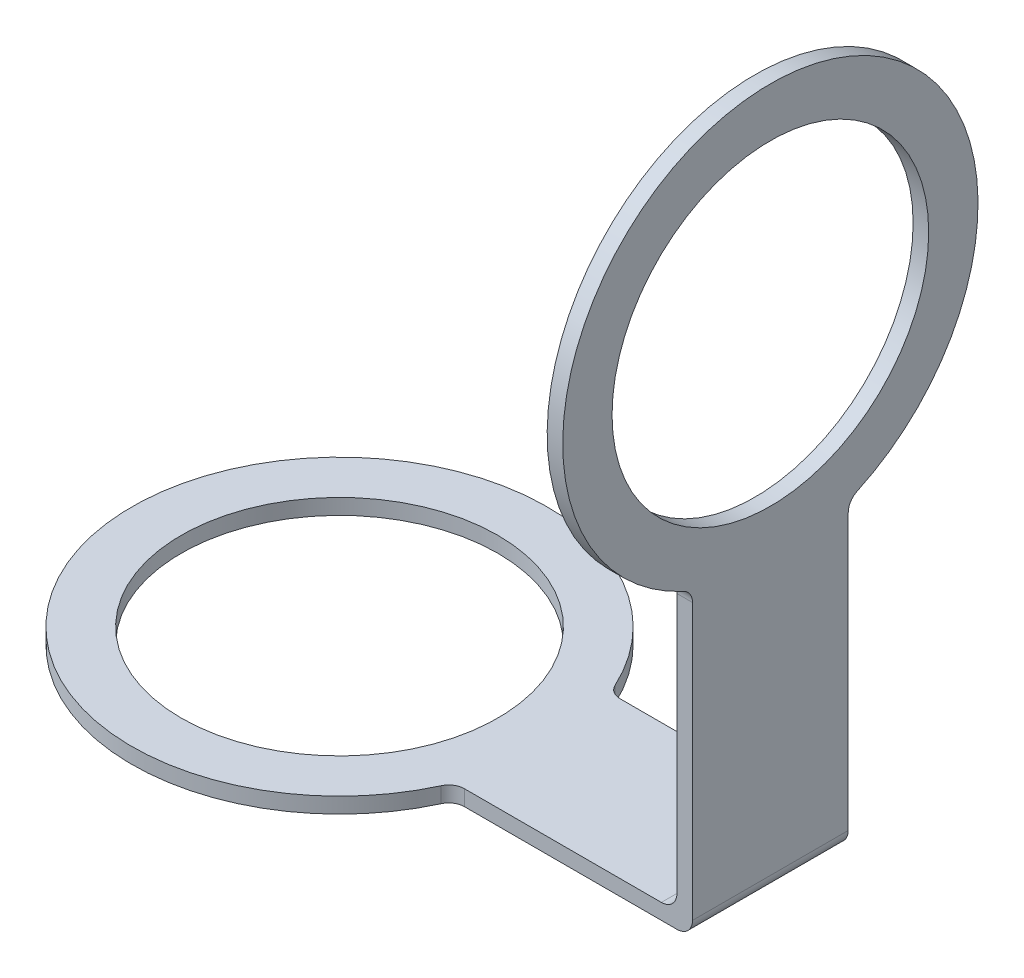
ISO-10303-21;
HEADER;
FILE_DESCRIPTION(('STEP AP214'),'2;1');
FILE_NAME('part.step','',(''),(''),'','','');
FILE_SCHEMA(('AUTOMOTIVE_DESIGN { 1 0 10303 214 1 1 1 1 }'));
ENDSEC;
DATA;
#1=APPLICATION_CONTEXT('core data for automotive mechanical design processes');
#2=APPLICATION_PROTOCOL_DEFINITION('international standard','automotive_design',2000,#1);
#3=PRODUCT_CONTEXT('',#1,'mechanical');
#4=PRODUCT('Part','Part','',(#3));
#5=PRODUCT_RELATED_PRODUCT_CATEGORY('part','',(#4));
#6=PRODUCT_DEFINITION_FORMATION('','',#4);
#7=PRODUCT_DEFINITION_CONTEXT('part definition',#1,'design');
#8=PRODUCT_DEFINITION('design','',#6,#7);
#9=PRODUCT_DEFINITION_SHAPE('','',#8);
#10=(LENGTH_UNIT() NAMED_UNIT(*) SI_UNIT(.MILLI.,.METRE.));
#11=(NAMED_UNIT(*) PLANE_ANGLE_UNIT() SI_UNIT($,.RADIAN.));
#12=(NAMED_UNIT(*) SI_UNIT($,.STERADIAN.) SOLID_ANGLE_UNIT());
#13=UNCERTAINTY_MEASURE_WITH_UNIT(LENGTH_MEASURE(1.E-05),#10,'distance_accuracy_value','');
#14=(GEOMETRIC_REPRESENTATION_CONTEXT(3) GLOBAL_UNCERTAINTY_ASSIGNED_CONTEXT((#13)) GLOBAL_UNIT_ASSIGNED_CONTEXT((#10,
#11,#12)) REPRESENTATION_CONTEXT('',''));
#15=CARTESIAN_POINT('',(0.,0.,0.));
#16=DIRECTION('',(0.,0.,1.));
#17=DIRECTION('',(1.,0.,0.));
#18=AXIS2_PLACEMENT_3D('',#15,#16,#17);
#19=CARTESIAN_POINT('',(0.,3.,0.));
#20=DIRECTION('',(0.,1.,0.));
#21=DIRECTION('',(0.,0.,1.));
#22=AXIS2_PLACEMENT_3D('',#19,#20,#21);
#23=PLANE('',#22);
#24=CARTESIAN_POINT('',(0.,3.,0.));
#25=DIRECTION('',(0.,1.,0.));
#26=DIRECTION('',(0.,0.,1.));
#27=AXIS2_PLACEMENT_3D('',#24,#25,#26);
#28=CIRCLE('',#27,30.5);
#29=CARTESIAN_POINT('',(0.,3.,30.5));
#30=VERTEX_POINT('',#29);
#31=EDGE_CURVE('E230',#30,#30,#28,.T.);
#32=ORIENTED_EDGE('',*,*,#31,.F.);
#33=EDGE_LOOP('',(#32));
#34=FACE_BOUND('',#33,.T.);
#35=DIRECTION('',(1.,0.,0.));
#36=VECTOR('',#35,1.);
#37=CARTESIAN_POINT('',(35.,3.,15.));
#38=LINE('',#37,#36);
#39=CARTESIAN_POINT('',(39.0512483795333,3.,15.));
#40=VERTEX_POINT('',#39);
#41=CARTESIAN_POINT('',(77.,3.,15.));
#42=VERTEX_POINT('',#41);
#43=EDGE_CURVE('E215',#40,#42,#38,.T.);
#44=ORIENTED_EDGE('',*,*,#43,.T.);
#45=DIRECTION('',(0.,0.,-1.));
#46=VECTOR('',#45,1.);
#47=CARTESIAN_POINT('',(77.,3.,0.));
#48=LINE('',#47,#46);
#49=CARTESIAN_POINT('',(77.,3.,-15.));
#50=VERTEX_POINT('',#49);
#51=EDGE_CURVE('E183',#42,#50,#48,.T.);
#52=ORIENTED_EDGE('',*,*,#51,.T.);
#53=DIRECTION('',(-1.,0.,0.));
#54=VECTOR('',#53,1.);
#55=CARTESIAN_POINT('',(35.,3.,-15.));
#56=LINE('',#55,#54);
#57=CARTESIAN_POINT('',(39.0512483795333,3.,-15.));
#58=VERTEX_POINT('',#57);
#59=EDGE_CURVE('E199',#50,#58,#56,.T.);
#60=ORIENTED_EDGE('',*,*,#59,.T.);
#61=CARTESIAN_POINT('',(39.0512483795333,3.,-18.));
#62=DIRECTION('',(0.,1.,0.));
#63=DIRECTION('',(0.,0.,1.));
#64=AXIS2_PLACEMENT_3D('',#61,#62,#63);
#65=CIRCLE('',#64,3.);
#66=CARTESIAN_POINT('',(36.3267426786356,3.,-16.7441860465116));
#67=VERTEX_POINT('',#66);
#68=EDGE_CURVE('E181',#58,#67,#65,.F.);
#69=ORIENTED_EDGE('',*,*,#68,.T.);
#70=CARTESIAN_POINT('',(0.,3.,0.));
#71=DIRECTION('',(0.,1.,0.));
#72=DIRECTION('',(0.,0.,1.));
#73=AXIS2_PLACEMENT_3D('',#70,#71,#72);
#74=CIRCLE('',#73,40.);
#75=CARTESIAN_POINT('',(36.3267426786356,3.,16.7441860465116));
#76=VERTEX_POINT('',#75);
#77=EDGE_CURVE('E147',#67,#76,#74,.T.);
#78=ORIENTED_EDGE('',*,*,#77,.T.);
#79=CARTESIAN_POINT('',(39.0512483795333,3.,18.));
#80=DIRECTION('',(0.,1.,0.));
#81=DIRECTION('',(0.,0.,1.));
#82=AXIS2_PLACEMENT_3D('',#79,#80,#81);
#83=CIRCLE('',#82,3.);
#84=EDGE_CURVE('E175',#76,#40,#83,.F.);
#85=ORIENTED_EDGE('',*,*,#84,.T.);
#86=EDGE_LOOP('',(#44,#52,#60,#69,#78,#85));
#87=FACE_BOUND('',#86,.T.);
#88=ADVANCED_FACE('F32',(#34,#87),#23,.T.);
#89=CARTESIAN_POINT('',(0.,0.,0.));
#90=DIRECTION('',(0.,1.,0.));
#91=DIRECTION('',(0.,0.,1.));
#92=AXIS2_PLACEMENT_3D('',#89,#90,#91);
#93=PLANE('',#92);
#94=DIRECTION('',(1.,0.,0.));
#95=VECTOR('',#94,1.);
#96=CARTESIAN_POINT('',(35.,0.,-15.));
#97=LINE('',#96,#95);
#98=CARTESIAN_POINT('',(39.0512483795333,0.,-15.));
#99=VERTEX_POINT('',#98);
#100=CARTESIAN_POINT('',(80.,0.,-15.));
#101=VERTEX_POINT('',#100);
#102=EDGE_CURVE('E223',#99,#101,#97,.T.);
#103=ORIENTED_EDGE('',*,*,#102,.T.);
#104=DIRECTION('',(0.,0.,1.));
#105=VECTOR('',#104,1.);
#106=CARTESIAN_POINT('',(80.,0.,15.));
#107=LINE('',#106,#105);
#108=CARTESIAN_POINT('',(80.,0.,15.));
#109=VERTEX_POINT('',#108);
#110=EDGE_CURVE('E188',#101,#109,#107,.T.);
#111=ORIENTED_EDGE('',*,*,#110,.T.);
#112=DIRECTION('',(-1.,0.,0.));
#113=VECTOR('',#112,1.);
#114=CARTESIAN_POINT('',(35.,0.,15.));
#115=LINE('',#114,#113);
#116=CARTESIAN_POINT('',(39.0512483795333,0.,15.));
#117=VERTEX_POINT('',#116);
#118=EDGE_CURVE('E227',#109,#117,#115,.T.);
#119=ORIENTED_EDGE('',*,*,#118,.T.);
#120=CARTESIAN_POINT('',(39.0512483795333,0.,18.));
#121=DIRECTION('',(0.,1.,0.));
#122=DIRECTION('',(0.,0.,1.));
#123=AXIS2_PLACEMENT_3D('',#120,#121,#122);
#124=CIRCLE('',#123,3.);
#125=CARTESIAN_POINT('',(36.3267426786356,0.,16.7441860465116));
#126=VERTEX_POINT('',#125);
#127=EDGE_CURVE('E177',#117,#126,#124,.T.);
#128=ORIENTED_EDGE('',*,*,#127,.T.);
#129=CARTESIAN_POINT('',(0.,0.,0.));
#130=DIRECTION('',(0.,1.,0.));
#131=DIRECTION('',(0.,0.,1.));
#132=AXIS2_PLACEMENT_3D('',#129,#130,#131);
#133=CIRCLE('',#132,40.);
#134=CARTESIAN_POINT('',(36.3267426786356,0.,-16.7441860465116));
#135=VERTEX_POINT('',#134);
#136=EDGE_CURVE('E152',#135,#126,#133,.T.);
#137=ORIENTED_EDGE('',*,*,#136,.F.);
#138=CARTESIAN_POINT('',(39.0512483795333,0.,-18.));
#139=DIRECTION('',(0.,1.,0.));
#140=DIRECTION('',(0.,0.,1.));
#141=AXIS2_PLACEMENT_3D('',#138,#139,#140);
#142=CIRCLE('',#141,3.);
#143=EDGE_CURVE('E179',#135,#99,#142,.T.);
#144=ORIENTED_EDGE('',*,*,#143,.T.);
#145=EDGE_LOOP('',(#103,#111,#119,#128,#137,#144));
#146=FACE_BOUND('',#145,.T.);
#147=CARTESIAN_POINT('',(0.,0.,0.));
#148=DIRECTION('',(0.,1.,0.));
#149=DIRECTION('',(0.,0.,1.));
#150=AXIS2_PLACEMENT_3D('',#147,#148,#149);
#151=CIRCLE('',#150,30.5);
#152=CARTESIAN_POINT('',(0.,0.,30.5));
#153=VERTEX_POINT('',#152);
#154=EDGE_CURVE('E229',#153,#153,#151,.T.);
#155=ORIENTED_EDGE('',*,*,#154,.T.);
#156=EDGE_LOOP('',(#155));
#157=FACE_BOUND('',#156,.T.);
#158=ADVANCED_FACE('F236',(#146,#157),#93,.F.);
#159=CARTESIAN_POINT('',(0.,3.,0.));
#160=DIRECTION('',(0.,-1.,0.));
#161=DIRECTION('',(0.,0.,-1.));
#162=AXIS2_PLACEMENT_3D('',#159,#160,#161);
#163=CYLINDRICAL_SURFACE('',#162,40.);
#164=ORIENTED_EDGE('',*,*,#136,.T.);
#165=DIRECTION('',(0.,-1.,0.));
#166=VECTOR('',#165,1.);
#167=CARTESIAN_POINT('',(36.3267426786356,3.,16.7441860465116));
#168=LINE('',#167,#166);
#169=EDGE_CURVE('E168',#126,#76,#168,.F.);
#170=ORIENTED_EDGE('',*,*,#169,.T.);
#171=ORIENTED_EDGE('',*,*,#77,.F.);
#172=DIRECTION('',(0.,-1.,0.));
#173=VECTOR('',#172,1.);
#174=CARTESIAN_POINT('',(36.3267426786356,3.,-16.7441860465116));
#175=LINE('',#174,#173);
#176=EDGE_CURVE('E165',#67,#135,#175,.T.);
#177=ORIENTED_EDGE('',*,*,#176,.T.);
#178=EDGE_LOOP('',(#164,#170,#171,#177));
#179=FACE_BOUND('',#178,.T.);
#180=ADVANCED_FACE('F240',(#179),#163,.T.);
#181=CARTESIAN_POINT('',(0.,3.,0.));
#182=DIRECTION('',(0.,-1.,0.));
#183=DIRECTION('',(0.,0.,-1.));
#184=AXIS2_PLACEMENT_3D('',#181,#182,#183);
#185=CYLINDRICAL_SURFACE('',#184,30.5);
#186=ORIENTED_EDGE('',*,*,#31,.T.);
#187=EDGE_LOOP('',(#186));
#188=FACE_BOUND('',#187,.T.);
#189=ORIENTED_EDGE('',*,*,#154,.F.);
#190=EDGE_LOOP('',(#189));
#191=FACE_BOUND('',#190,.T.);
#192=ADVANCED_FACE('F238',(#188,#191),#185,.F.);
#193=CARTESIAN_POINT('',(35.,-56.6038867923396,-15.));
#194=DIRECTION('',(0.,0.,-1.));
#195=DIRECTION('',(-1.,0.,0.));
#196=AXIS2_PLACEMENT_3D('',#193,#194,#195);
#197=PLANE('',#196);
#198=DIRECTION('',(0.,1.,0.));
#199=VECTOR('',#198,1.);
#200=CARTESIAN_POINT('',(83.,-56.6038867923396,-15.));
#201=LINE('',#200,#199);
#202=CARTESIAN_POINT('',(83.,2.99999999999999,-15.));
#203=VERTEX_POINT('',#202);
#204=CARTESIAN_POINT('',(83.,56.029744055945,-15.));
#205=VERTEX_POINT('',#204);
#206=EDGE_CURVE('E125',#203,#205,#201,.T.);
#207=ORIENTED_EDGE('',*,*,#206,.F.);
#208=CARTESIAN_POINT('',(80.,3.,-15.));
#209=DIRECTION('',(0.,0.,-1.));
#210=DIRECTION('',(-1.,0.,0.));
#211=AXIS2_PLACEMENT_3D('',#208,#209,#210);
#212=CIRCLE('',#211,3.);
#213=EDGE_CURVE('E193',#203,#101,#212,.T.);
#214=ORIENTED_EDGE('',*,*,#213,.T.);
#215=ORIENTED_EDGE('',*,*,#102,.F.);
#216=DIRECTION('',(0.,-1.,0.));
#217=VECTOR('',#216,1.);
#218=CARTESIAN_POINT('',(39.0512483795333,-56.6038867923396,-15.));
#219=LINE('',#218,#217);
#220=EDGE_CURVE('E160',#99,#58,#219,.F.);
#221=ORIENTED_EDGE('',*,*,#220,.T.);
#222=ORIENTED_EDGE('',*,*,#59,.F.);
#223=CARTESIAN_POINT('',(77.,6.,-15.));
#224=DIRECTION('',(0.,0.,-1.));
#225=DIRECTION('',(-1.,0.,0.));
#226=AXIS2_PLACEMENT_3D('',#223,#224,#225);
#227=CIRCLE('',#226,3.);
#228=CARTESIAN_POINT('',(80.,6.,-15.));
#229=VERTEX_POINT('',#228);
#230=EDGE_CURVE('E40',#50,#229,#227,.F.);
#231=ORIENTED_EDGE('',*,*,#230,.T.);
#232=DIRECTION('',(0.,1.,0.));
#233=VECTOR('',#232,1.);
#234=CARTESIAN_POINT('',(80.,0.,-15.));
#235=LINE('',#234,#233);
#236=CARTESIAN_POINT('',(80.,56.029744055945,-15.));
#237=VERTEX_POINT('',#236);
#238=EDGE_CURVE('E198',#229,#237,#235,.T.);
#239=ORIENTED_EDGE('',*,*,#238,.T.);
#240=DIRECTION('',(-1.,0.,0.));
#241=VECTOR('',#240,1.);
#242=CARTESIAN_POINT('',(83.,56.029744055945,-15.));
#243=LINE('',#242,#241);
#244=EDGE_CURVE('E163',#237,#205,#243,.F.);
#245=ORIENTED_EDGE('',*,*,#244,.T.);
#246=EDGE_LOOP('',(#207,#214,#215,#221,#222,#231,#239,#245));
#247=FACE_BOUND('',#246,.T.);
#248=ADVANCED_FACE('F197',(#247),#197,.T.);
#249=CARTESIAN_POINT('',(35.,-56.6038867923396,15.));
#250=DIRECTION('',(0.,0.,1.));
#251=DIRECTION('',(1.,0.,0.));
#252=AXIS2_PLACEMENT_3D('',#249,#250,#251);
#253=PLANE('',#252);
#254=ORIENTED_EDGE('',*,*,#118,.F.);
#255=CARTESIAN_POINT('',(80.,3.,15.));
#256=DIRECTION('',(0.,0.,1.));
#257=DIRECTION('',(1.,0.,0.));
#258=AXIS2_PLACEMENT_3D('',#255,#256,#257);
#259=CIRCLE('',#258,3.);
#260=CARTESIAN_POINT('',(83.,2.99999999999999,15.));
#261=VERTEX_POINT('',#260);
#262=EDGE_CURVE('E55',#109,#261,#259,.T.);
#263=ORIENTED_EDGE('',*,*,#262,.T.);
#264=DIRECTION('',(0.,1.,0.));
#265=VECTOR('',#264,1.);
#266=CARTESIAN_POINT('',(83.,-56.6038867923396,15.));
#267=LINE('',#266,#265);
#268=CARTESIAN_POINT('',(83.,56.029744055945,15.));
#269=VERTEX_POINT('',#268);
#270=EDGE_CURVE('E219',#261,#269,#267,.T.);
#271=ORIENTED_EDGE('',*,*,#270,.T.);
#272=DIRECTION('',(-1.,0.,0.));
#273=VECTOR('',#272,1.);
#274=CARTESIAN_POINT('',(80.,56.029744055945,15.));
#275=LINE('',#274,#273);
#276=CARTESIAN_POINT('',(80.,56.029744055945,15.));
#277=VERTEX_POINT('',#276);
#278=EDGE_CURVE('E158',#269,#277,#275,.T.);
#279=ORIENTED_EDGE('',*,*,#278,.T.);
#280=DIRECTION('',(0.,-1.,0.));
#281=VECTOR('',#280,1.);
#282=CARTESIAN_POINT('',(80.,0.,15.));
#283=LINE('',#282,#281);
#284=CARTESIAN_POINT('',(80.,6.,15.));
#285=VERTEX_POINT('',#284);
#286=EDGE_CURVE('E141',#277,#285,#283,.T.);
#287=ORIENTED_EDGE('',*,*,#286,.T.);
#288=CARTESIAN_POINT('',(77.,6.,15.));
#289=DIRECTION('',(0.,0.,1.));
#290=DIRECTION('',(1.,0.,0.));
#291=AXIS2_PLACEMENT_3D('',#288,#289,#290);
#292=CIRCLE('',#291,3.);
#293=EDGE_CURVE('E11',#285,#42,#292,.F.);
#294=ORIENTED_EDGE('',*,*,#293,.T.);
#295=ORIENTED_EDGE('',*,*,#43,.F.);
#296=DIRECTION('',(0.,-1.,0.));
#297=VECTOR('',#296,1.);
#298=CARTESIAN_POINT('',(39.0512483795333,-56.6038867923396,15.));
#299=LINE('',#298,#297);
#300=EDGE_CURVE('E149',#40,#117,#299,.T.);
#301=ORIENTED_EDGE('',*,*,#300,.T.);
#302=EDGE_LOOP('',(#254,#263,#271,#279,#287,#294,#295,#301));
#303=FACE_BOUND('',#302,.T.);
#304=ADVANCED_FACE('F214',(#303),#253,.T.);
#305=CARTESIAN_POINT('',(83.,-56.6038867923396,-15.));
#306=DIRECTION('',(1.,0.,0.));
#307=DIRECTION('',(0.,0.,-1.));
#308=AXIS2_PLACEMENT_3D('',#305,#306,#307);
#309=PLANE('',#308);
#310=ORIENTED_EDGE('',*,*,#270,.F.);
#311=DIRECTION('',(0.,0.,1.));
#312=VECTOR('',#311,1.);
#313=CARTESIAN_POINT('',(83.,3.,-15.));
#314=LINE('',#313,#312);
#315=EDGE_CURVE('E47',#261,#203,#314,.F.);
#316=ORIENTED_EDGE('',*,*,#315,.T.);
#317=ORIENTED_EDGE('',*,*,#206,.T.);
#318=CARTESIAN_POINT('',(83.,56.029744055945,-18.));
#319=DIRECTION('',(1.,0.,0.));
#320=DIRECTION('',(0.,0.,-1.));
#321=AXIS2_PLACEMENT_3D('',#318,#319,#320);
#322=CIRCLE('',#321,3.);
#323=CARTESIAN_POINT('',(83.,58.7542497568427,-16.7441860465116));
#324=VERTEX_POINT('',#323);
#325=EDGE_CURVE('E119',#205,#324,#322,.F.);
#326=ORIENTED_EDGE('',*,*,#325,.T.);
#327=CARTESIAN_POINT('',(83.,95.0809924354783,0.));
#328=DIRECTION('',(1.,0.,0.));
#329=DIRECTION('',(0.,0.,-1.));
#330=AXIS2_PLACEMENT_3D('',#327,#328,#329);
#331=CIRCLE('',#330,40.);
#332=CARTESIAN_POINT('',(83.,58.7542497568427,16.7441860465116));
#333=VERTEX_POINT('',#332);
#334=EDGE_CURVE('E124',#324,#333,#331,.T.);
#335=ORIENTED_EDGE('',*,*,#334,.T.);
#336=CARTESIAN_POINT('',(83.,56.029744055945,18.));
#337=DIRECTION('',(1.,0.,0.));
#338=DIRECTION('',(0.,0.,-1.));
#339=AXIS2_PLACEMENT_3D('',#336,#337,#338);
#340=CIRCLE('',#339,3.);
#341=EDGE_CURVE('E171',#333,#269,#340,.F.);
#342=ORIENTED_EDGE('',*,*,#341,.T.);
#343=EDGE_LOOP('',(#310,#316,#317,#326,#335,#342));
#344=FACE_BOUND('',#343,.T.);
#345=CARTESIAN_POINT('',(83.,95.0809924354783,0.));
#346=DIRECTION('',(1.,0.,0.));
#347=DIRECTION('',(0.,0.,-1.));
#348=AXIS2_PLACEMENT_3D('',#345,#346,#347);
#349=CIRCLE('',#348,30.5);
#350=CARTESIAN_POINT('',(83.,95.0809924354783,-30.5));
#351=VERTEX_POINT('',#350);
#352=EDGE_CURVE('E402',#351,#351,#349,.T.);
#353=ORIENTED_EDGE('',*,*,#352,.F.);
#354=EDGE_LOOP('',(#353));
#355=FACE_BOUND('',#354,.T.);
#356=ADVANCED_FACE('F121',(#344,#355),#309,.T.);
#357=CARTESIAN_POINT('',(80.,95.0809924354783,0.));
#358=DIRECTION('',(1.,0.,0.));
#359=DIRECTION('',(0.,0.,-1.));
#360=AXIS2_PLACEMENT_3D('',#357,#358,#359);
#361=CYLINDRICAL_SURFACE('',#360,40.);
#362=CARTESIAN_POINT('',(80.,95.0809924354783,0.));
#363=DIRECTION('',(1.,0.,0.));
#364=DIRECTION('',(0.,0.,-1.));
#365=AXIS2_PLACEMENT_3D('',#362,#363,#364);
#366=CIRCLE('',#365,40.);
#367=CARTESIAN_POINT('',(80.,58.7542497568427,-16.7441860465116));
#368=VERTEX_POINT('',#367);
#369=CARTESIAN_POINT('',(80.,58.7542497568427,16.7441860465116));
#370=VERTEX_POINT('',#369);
#371=EDGE_CURVE('E208',#368,#370,#366,.T.);
#372=ORIENTED_EDGE('',*,*,#371,.T.);
#373=DIRECTION('',(1.,0.,0.));
#374=VECTOR('',#373,1.);
#375=CARTESIAN_POINT('',(80.,58.7542497568427,16.7441860465116));
#376=LINE('',#375,#374);
#377=EDGE_CURVE('E140',#370,#333,#376,.T.);
#378=ORIENTED_EDGE('',*,*,#377,.T.);
#379=ORIENTED_EDGE('',*,*,#334,.F.);
#380=DIRECTION('',(1.,0.,0.));
#381=VECTOR('',#380,1.);
#382=CARTESIAN_POINT('',(80.,58.7542497568427,-16.7441860465116));
#383=LINE('',#382,#381);
#384=EDGE_CURVE('E137',#324,#368,#383,.F.);
#385=ORIENTED_EDGE('',*,*,#384,.T.);
#386=EDGE_LOOP('',(#372,#378,#379,#385));
#387=FACE_BOUND('',#386,.T.);
#388=ADVANCED_FACE('F136',(#387),#361,.T.);
#389=CARTESIAN_POINT('',(80.,95.0809924354783,0.));
#390=DIRECTION('',(1.,0.,0.));
#391=DIRECTION('',(0.,0.,-1.));
#392=AXIS2_PLACEMENT_3D('',#389,#390,#391);
#393=PLANE('',#392);
#394=ORIENTED_EDGE('',*,*,#238,.F.);
#395=DIRECTION('',(0.,0.,-1.));
#396=VECTOR('',#395,1.);
#397=CARTESIAN_POINT('',(80.,6.00000000000001,0.));
#398=LINE('',#397,#396);
#399=EDGE_CURVE('E186',#229,#285,#398,.F.);
#400=ORIENTED_EDGE('',*,*,#399,.T.);
#401=ORIENTED_EDGE('',*,*,#286,.F.);
#402=CARTESIAN_POINT('',(80.,56.029744055945,18.));
#403=DIRECTION('',(1.,0.,0.));
#404=DIRECTION('',(0.,0.,-1.));
#405=AXIS2_PLACEMENT_3D('',#402,#403,#404);
#406=CIRCLE('',#405,3.);
#407=EDGE_CURVE('E131',#277,#370,#406,.T.);
#408=ORIENTED_EDGE('',*,*,#407,.T.);
#409=ORIENTED_EDGE('',*,*,#371,.F.);
#410=CARTESIAN_POINT('',(80.,56.029744055945,-18.));
#411=DIRECTION('',(1.,0.,0.));
#412=DIRECTION('',(0.,0.,-1.));
#413=AXIS2_PLACEMENT_3D('',#410,#411,#412);
#414=CIRCLE('',#413,3.);
#415=EDGE_CURVE('E130',#368,#237,#414,.T.);
#416=ORIENTED_EDGE('',*,*,#415,.T.);
#417=EDGE_LOOP('',(#394,#400,#401,#408,#409,#416));
#418=FACE_BOUND('',#417,.T.);
#419=CARTESIAN_POINT('',(80.,95.0809924354783,0.));
#420=DIRECTION('',(1.,0.,0.));
#421=DIRECTION('',(0.,0.,-1.));
#422=AXIS2_PLACEMENT_3D('',#419,#420,#421);
#423=CIRCLE('',#422,30.5);
#424=CARTESIAN_POINT('',(80.,95.0809924354783,-30.5));
#425=VERTEX_POINT('',#424);
#426=EDGE_CURVE('E142',#425,#425,#423,.T.);
#427=ORIENTED_EDGE('',*,*,#426,.T.);
#428=EDGE_LOOP('',(#427));
#429=FACE_BOUND('',#428,.T.);
#430=ADVANCED_FACE('F204',(#418,#429),#393,.F.);
#431=CARTESIAN_POINT('',(80.,95.0809924354783,0.));
#432=DIRECTION('',(1.,0.,0.));
#433=DIRECTION('',(0.,0.,-1.));
#434=AXIS2_PLACEMENT_3D('',#431,#432,#433);
#435=CYLINDRICAL_SURFACE('',#434,30.5);
#436=ORIENTED_EDGE('',*,*,#426,.F.);
#437=EDGE_LOOP('',(#436));
#438=FACE_BOUND('',#437,.T.);
#439=ORIENTED_EDGE('',*,*,#352,.T.);
#440=EDGE_LOOP('',(#439));
#441=FACE_BOUND('',#440,.T.);
#442=ADVANCED_FACE('F264',(#438,#441),#435,.F.);
#443=CARTESIAN_POINT('',(80.,56.029744055945,18.));
#444=DIRECTION('',(1.,0.,0.));
#445=DIRECTION('',(0.,0.,-1.));
#446=AXIS2_PLACEMENT_3D('',#443,#444,#445);
#447=CYLINDRICAL_SURFACE('',#446,3.);
#448=ORIENTED_EDGE('',*,*,#407,.F.);
#449=ORIENTED_EDGE('',*,*,#278,.F.);
#450=ORIENTED_EDGE('',*,*,#341,.F.);
#451=ORIENTED_EDGE('',*,*,#377,.F.);
#452=EDGE_LOOP('',(#448,#449,#450,#451));
#453=FACE_BOUND('',#452,.T.);
#454=ADVANCED_FACE('F261',(#453),#447,.F.);
#455=CARTESIAN_POINT('',(80.,56.029744055945,-18.));
#456=DIRECTION('',(1.,0.,0.));
#457=DIRECTION('',(0.,0.,-1.));
#458=AXIS2_PLACEMENT_3D('',#455,#456,#457);
#459=CYLINDRICAL_SURFACE('',#458,3.);
#460=ORIENTED_EDGE('',*,*,#415,.F.);
#461=ORIENTED_EDGE('',*,*,#384,.F.);
#462=ORIENTED_EDGE('',*,*,#325,.F.);
#463=ORIENTED_EDGE('',*,*,#244,.F.);
#464=EDGE_LOOP('',(#460,#461,#462,#463));
#465=FACE_BOUND('',#464,.T.);
#466=ADVANCED_FACE('F145',(#465),#459,.F.);
#467=CARTESIAN_POINT('',(39.0512483795333,3.,18.));
#468=DIRECTION('',(0.,-1.,0.));
#469=DIRECTION('',(0.,0.,-1.));
#470=AXIS2_PLACEMENT_3D('',#467,#468,#469);
#471=CYLINDRICAL_SURFACE('',#470,3.);
#472=ORIENTED_EDGE('',*,*,#127,.F.);
#473=ORIENTED_EDGE('',*,*,#300,.F.);
#474=ORIENTED_EDGE('',*,*,#84,.F.);
#475=ORIENTED_EDGE('',*,*,#169,.F.);
#476=EDGE_LOOP('',(#472,#473,#474,#475));
#477=FACE_BOUND('',#476,.T.);
#478=ADVANCED_FACE('F268',(#477),#471,.F.);
#479=CARTESIAN_POINT('',(39.0512483795333,3.,-18.));
#480=DIRECTION('',(0.,-1.,0.));
#481=DIRECTION('',(0.,0.,-1.));
#482=AXIS2_PLACEMENT_3D('',#479,#480,#481);
#483=CYLINDRICAL_SURFACE('',#482,3.);
#484=ORIENTED_EDGE('',*,*,#68,.F.);
#485=ORIENTED_EDGE('',*,*,#220,.F.);
#486=ORIENTED_EDGE('',*,*,#143,.F.);
#487=ORIENTED_EDGE('',*,*,#176,.F.);
#488=EDGE_LOOP('',(#484,#485,#486,#487));
#489=FACE_BOUND('',#488,.T.);
#490=ADVANCED_FACE('F271',(#489),#483,.F.);
#491=CARTESIAN_POINT('',(77.,6.,0.));
#492=DIRECTION('',(0.,0.,-1.));
#493=DIRECTION('',(-1.,0.,0.));
#494=AXIS2_PLACEMENT_3D('',#491,#492,#493);
#495=CYLINDRICAL_SURFACE('',#494,3.);
#496=ORIENTED_EDGE('',*,*,#293,.F.);
#497=ORIENTED_EDGE('',*,*,#399,.F.);
#498=ORIENTED_EDGE('',*,*,#230,.F.);
#499=ORIENTED_EDGE('',*,*,#51,.F.);
#500=EDGE_LOOP('',(#496,#497,#498,#499));
#501=FACE_BOUND('',#500,.T.);
#502=ADVANCED_FACE('F211',(#501),#495,.F.);
#503=CARTESIAN_POINT('',(80.,3.,0.));
#504=DIRECTION('',(0.,0.,-1.));
#505=DIRECTION('',(-1.,0.,0.));
#506=AXIS2_PLACEMENT_3D('',#503,#504,#505);
#507=CYLINDRICAL_SURFACE('',#506,3.);
#508=ORIENTED_EDGE('',*,*,#213,.F.);
#509=ORIENTED_EDGE('',*,*,#315,.F.);
#510=ORIENTED_EDGE('',*,*,#262,.F.);
#511=ORIENTED_EDGE('',*,*,#110,.F.);
#512=EDGE_LOOP('',(#508,#509,#510,#511));
#513=FACE_BOUND('',#512,.T.);
#514=ADVANCED_FACE('F34',(#513),#507,.T.);
#515=CLOSED_SHELL('',(#88,#158,#180,#192,#248,#304,#356,#388,#430,#442,#454,#466,#478,#490,#502,#514));
#516=MANIFOLD_SOLID_BREP('B2',#515);
#517=ADVANCED_BREP_SHAPE_REPRESENTATION('',(#18,#516),#14);
#518=SHAPE_DEFINITION_REPRESENTATION(#9,#517);
ENDSEC;
END-ISO-10303-21;
